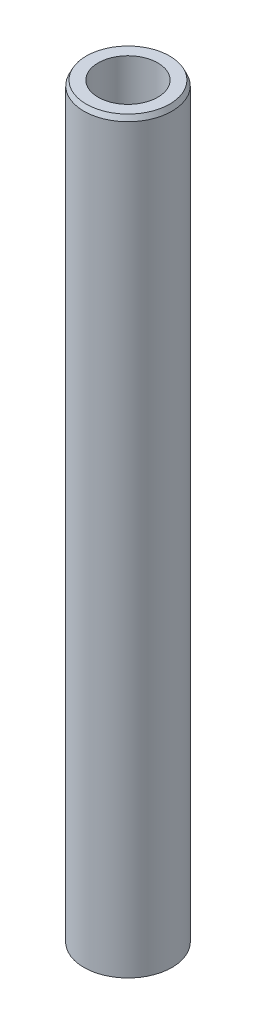
ISO-10303-21;
HEADER;
FILE_DESCRIPTION(('STEP AP214'),'2;1');
FILE_NAME('part.step','',(''),(''),'','','');
FILE_SCHEMA(('AUTOMOTIVE_DESIGN { 1 0 10303 214 1 1 1 1 }'));
ENDSEC;
DATA;
#1=APPLICATION_CONTEXT('core data for automotive mechanical design processes');
#2=APPLICATION_PROTOCOL_DEFINITION('international standard','automotive_design',2000,#1);
#3=PRODUCT_CONTEXT('',#1,'mechanical');
#4=PRODUCT('Part','Part','',(#3));
#5=PRODUCT_RELATED_PRODUCT_CATEGORY('part','',(#4));
#6=PRODUCT_DEFINITION_FORMATION('','',#4);
#7=PRODUCT_DEFINITION_CONTEXT('part definition',#1,'design');
#8=PRODUCT_DEFINITION('design','',#6,#7);
#9=PRODUCT_DEFINITION_SHAPE('','',#8);
#10=(LENGTH_UNIT() NAMED_UNIT(*) SI_UNIT(.MILLI.,.METRE.));
#11=(NAMED_UNIT(*) PLANE_ANGLE_UNIT() SI_UNIT($,.RADIAN.));
#12=(NAMED_UNIT(*) SI_UNIT($,.STERADIAN.) SOLID_ANGLE_UNIT());
#13=UNCERTAINTY_MEASURE_WITH_UNIT(LENGTH_MEASURE(1.E-05),#10,'distance_accuracy_value','');
#14=(GEOMETRIC_REPRESENTATION_CONTEXT(3) GLOBAL_UNCERTAINTY_ASSIGNED_CONTEXT((#13)) GLOBAL_UNIT_ASSIGNED_CONTEXT((#10,
#11,#12)) REPRESENTATION_CONTEXT('',''));
#15=CARTESIAN_POINT('',(0.,0.,0.));
#16=DIRECTION('',(0.,0.,1.));
#17=DIRECTION('',(1.,0.,0.));
#18=AXIS2_PLACEMENT_3D('',#15,#16,#17);
#19=CARTESIAN_POINT('',(0.,552.394427353077,0.));
#20=DIRECTION('',(0.,-1.,0.));
#21=DIRECTION('',(0.,0.,-1.));
#22=AXIS2_PLACEMENT_3D('',#19,#20,#21);
#23=CYLINDRICAL_SURFACE('',#22,32.5);
#24=CARTESIAN_POINT('',(0.,548.750271681619,0.));
#25=DIRECTION('',(0.,1.,0.));
#26=DIRECTION('',(0.,0.,1.));
#27=AXIS2_PLACEMENT_3D('',#24,#25,#26);
#28=CIRCLE('',#27,32.5);
#29=CARTESIAN_POINT('',(0.,548.750271681619,32.5));
#30=VERTEX_POINT('',#29);
#31=EDGE_CURVE('E50',#30,#30,#28,.F.);
#32=ORIENTED_EDGE('',*,*,#31,.T.);
#33=EDGE_LOOP('',(#32));
#34=FACE_BOUND('',#33,.T.);
#35=CARTESIAN_POINT('',(0.,1.73571221257907,0.));
#36=DIRECTION('',(0.,1.,0.));
#37=DIRECTION('',(0.,0.,1.));
#38=AXIS2_PLACEMENT_3D('',#35,#36,#37);
#39=CIRCLE('',#38,32.5);
#40=CARTESIAN_POINT('',(0.,1.73571221257907,32.5));
#41=VERTEX_POINT('',#40);
#42=EDGE_CURVE('E51',#41,#41,#39,.T.);
#43=ORIENTED_EDGE('',*,*,#42,.T.);
#44=EDGE_LOOP('',(#43));
#45=FACE_BOUND('',#44,.T.);
#46=ADVANCED_FACE('F39',(#34,#45),#23,.T.);
#47=CARTESIAN_POINT('',(0.,552.394427353077,0.));
#48=DIRECTION('',(0.,1.,0.));
#49=DIRECTION('',(0.,0.,1.));
#50=AXIS2_PLACEMENT_3D('',#47,#48,#49);
#51=PLANE('',#50);
#52=CARTESIAN_POINT('',(0.,552.394427353077,0.));
#53=DIRECTION('',(0.,1.,0.));
#54=DIRECTION('',(0.,0.,1.));
#55=AXIS2_PLACEMENT_3D('',#52,#53,#54);
#56=CIRCLE('',#55,30.764287787421);
#57=CARTESIAN_POINT('',(0.,552.394427353077,30.764287787421));
#58=VERTEX_POINT('',#57);
#59=EDGE_CURVE('E54',#58,#58,#56,.T.);
#60=ORIENTED_EDGE('',*,*,#59,.T.);
#61=EDGE_LOOP('',(#60));
#62=FACE_BOUND('',#61,.T.);
#63=CARTESIAN_POINT('',(0.,552.394427353077,0.));
#64=DIRECTION('',(0.,1.,0.));
#65=DIRECTION('',(0.,0.,1.));
#66=AXIS2_PLACEMENT_3D('',#63,#64,#65);
#67=CIRCLE('',#66,21.9899074531174);
#68=CARTESIAN_POINT('',(0.,552.394427353077,21.9899074531174));
#69=VERTEX_POINT('',#68);
#70=EDGE_CURVE('E58',#69,#69,#67,.T.);
#71=ORIENTED_EDGE('',*,*,#70,.F.);
#72=EDGE_LOOP('',(#71));
#73=FACE_BOUND('',#72,.T.);
#74=ADVANCED_FACE('F69',(#62,#73),#51,.T.);
#75=CARTESIAN_POINT('',(0.,0.,0.));
#76=DIRECTION('',(0.,1.,0.));
#77=DIRECTION('',(0.,0.,1.));
#78=AXIS2_PLACEMENT_3D('',#75,#76,#77);
#79=PLANE('',#78);
#80=CARTESIAN_POINT('',(0.,0.,0.));
#81=DIRECTION('',(0.,1.,0.));
#82=DIRECTION('',(0.,0.,1.));
#83=AXIS2_PLACEMENT_3D('',#80,#81,#82);
#84=CIRCLE('',#83,28.8558443285417);
#85=CARTESIAN_POINT('',(0.,0.,28.8558443285417));
#86=VERTEX_POINT('',#85);
#87=EDGE_CURVE('E10',#86,#86,#84,.F.);
#88=ORIENTED_EDGE('',*,*,#87,.T.);
#89=EDGE_LOOP('',(#88));
#90=FACE_BOUND('',#89,.T.);
#91=CARTESIAN_POINT('',(0.,0.,0.));
#92=DIRECTION('',(0.,1.,0.));
#93=DIRECTION('',(0.,0.,1.));
#94=AXIS2_PLACEMENT_3D('',#91,#92,#93);
#95=CIRCLE('',#94,21.9899074531174);
#96=CARTESIAN_POINT('',(0.,0.,21.9899074531174));
#97=VERTEX_POINT('',#96);
#98=EDGE_CURVE('E63',#97,#97,#95,.T.);
#99=ORIENTED_EDGE('',*,*,#98,.T.);
#100=EDGE_LOOP('',(#99));
#101=FACE_BOUND('',#100,.T.);
#102=ADVANCED_FACE('F75',(#90,#101),#79,.F.);
#103=CARTESIAN_POINT('',(0.,552.394427353077,0.));
#104=DIRECTION('',(0.,-1.,0.));
#105=DIRECTION('',(0.,0.,-1.));
#106=AXIS2_PLACEMENT_3D('',#103,#104,#105);
#107=CYLINDRICAL_SURFACE('',#106,21.9899074531174);
#108=ORIENTED_EDGE('',*,*,#70,.T.);
#109=EDGE_LOOP('',(#108));
#110=FACE_BOUND('',#109,.T.);
#111=ORIENTED_EDGE('',*,*,#98,.F.);
#112=EDGE_LOOP('',(#111));
#113=FACE_BOUND('',#112,.T.);
#114=ADVANCED_FACE('F70',(#110,#113),#107,.F.);
#115=CARTESIAN_POINT('',(0.,552.394427353077,0.));
#116=DIRECTION('',(0.,-1.,0.));
#117=DIRECTION('',(0.,0.,-1.));
#118=AXIS2_PLACEMENT_3D('',#115,#116,#117);
#119=CONICAL_SURFACE('',#118,30.764287787421,0.444508678975197);
#120=ORIENTED_EDGE('',*,*,#31,.F.);
#121=EDGE_LOOP('',(#120));
#122=FACE_BOUND('',#121,.T.);
#123=ORIENTED_EDGE('',*,*,#59,.F.);
#124=EDGE_LOOP('',(#123));
#125=FACE_BOUND('',#124,.T.);
#126=ADVANCED_FACE('F81',(#122,#125),#119,.T.);
#127=CARTESIAN_POINT('',(0.,1.73571221257907,0.));
#128=DIRECTION('',(0.,1.,0.));
#129=DIRECTION('',(0.,0.,1.));
#130=AXIS2_PLACEMENT_3D('',#127,#128,#129);
#131=CONICAL_SURFACE('',#130,32.5,1.12628764781971);
#132=ORIENTED_EDGE('',*,*,#87,.F.);
#133=EDGE_LOOP('',(#132));
#134=FACE_BOUND('',#133,.T.);
#135=ORIENTED_EDGE('',*,*,#42,.F.);
#136=EDGE_LOOP('',(#135));
#137=FACE_BOUND('',#136,.T.);
#138=ADVANCED_FACE('F45',(#134,#137),#131,.T.);
#139=CLOSED_SHELL('',(#46,#74,#102,#114,#126,#138));
#140=MANIFOLD_SOLID_BREP('B2',#139);
#141=ADVANCED_BREP_SHAPE_REPRESENTATION('',(#18,#140),#14);
#142=SHAPE_DEFINITION_REPRESENTATION(#9,#141);
ENDSEC;
END-ISO-10303-21;
